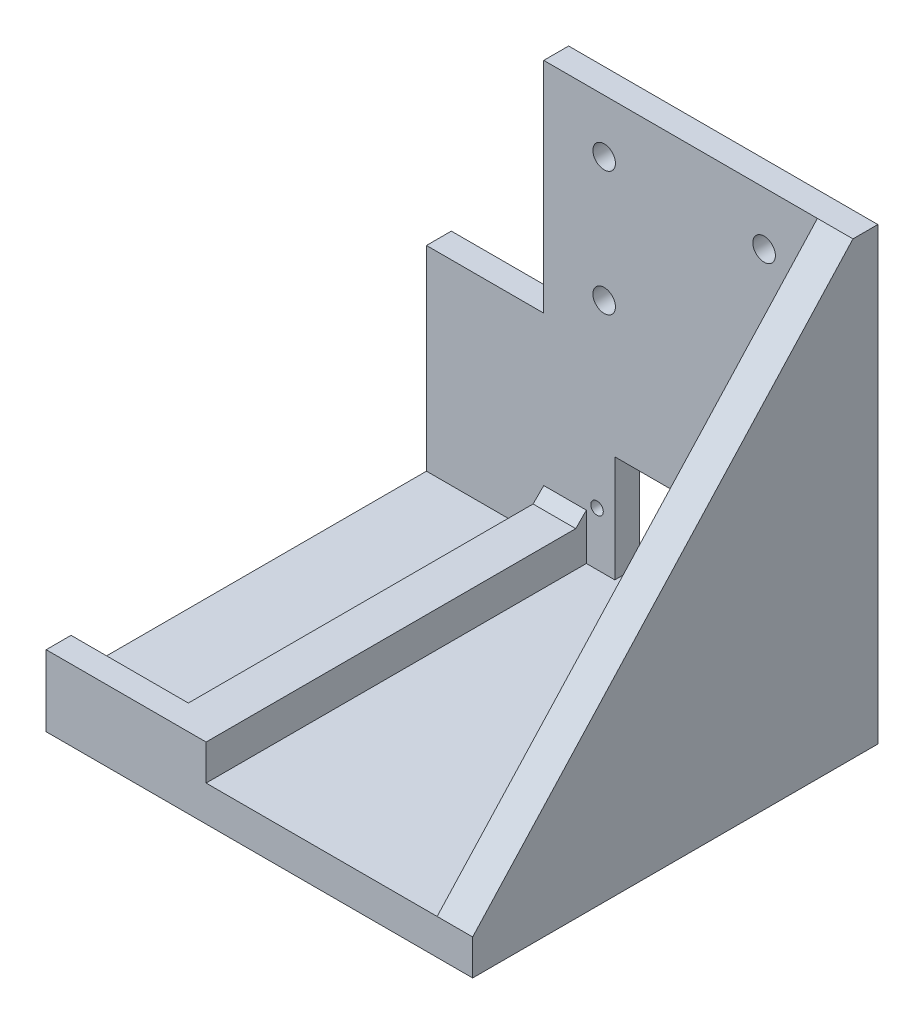
ISO-10303-21;
HEADER;
FILE_DESCRIPTION(('STEP AP214'),'2;1');
FILE_NAME('part.step','',(''),(''),'','','');
FILE_SCHEMA(('AUTOMOTIVE_DESIGN { 1 0 10303 214 1 1 1 1 }'));
ENDSEC;
DATA;
#1=APPLICATION_CONTEXT('core data for automotive mechanical design processes');
#2=APPLICATION_PROTOCOL_DEFINITION('international standard','automotive_design',2000,#1);
#3=PRODUCT_CONTEXT('',#1,'mechanical');
#4=PRODUCT('Part','Part','',(#3));
#5=PRODUCT_RELATED_PRODUCT_CATEGORY('part','',(#4));
#6=PRODUCT_DEFINITION_FORMATION('','',#4);
#7=PRODUCT_DEFINITION_CONTEXT('part definition',#1,'design');
#8=PRODUCT_DEFINITION('design','',#6,#7);
#9=PRODUCT_DEFINITION_SHAPE('','',#8);
#10=(LENGTH_UNIT() NAMED_UNIT(*) SI_UNIT(.MILLI.,.METRE.));
#11=(NAMED_UNIT(*) PLANE_ANGLE_UNIT() SI_UNIT($,.RADIAN.));
#12=(NAMED_UNIT(*) SI_UNIT($,.STERADIAN.) SOLID_ANGLE_UNIT());
#13=UNCERTAINTY_MEASURE_WITH_UNIT(LENGTH_MEASURE(1.E-05),#10,'distance_accuracy_value','');
#14=(GEOMETRIC_REPRESENTATION_CONTEXT(3) GLOBAL_UNCERTAINTY_ASSIGNED_CONTEXT((#13)) GLOBAL_UNIT_ASSIGNED_CONTEXT((#10,
#11,#12)) REPRESENTATION_CONTEXT('',''));
#15=CARTESIAN_POINT('',(0.,0.,0.));
#16=DIRECTION('',(0.,0.,1.));
#17=DIRECTION('',(1.,0.,0.));
#18=AXIS2_PLACEMENT_3D('',#15,#16,#17);
#19=CARTESIAN_POINT('',(37.,22.5,-57.));
#20=DIRECTION('',(-1.,0.,0.));
#21=DIRECTION('',(0.,0.,1.));
#22=AXIS2_PLACEMENT_3D('',#19,#20,#21);
#23=PLANE('',#22);
#24=DIRECTION('',(0.,1.,0.));
#25=VECTOR('',#24,1.);
#26=CARTESIAN_POINT('',(37.,22.5,-54.));
#27=LINE('',#26,#25);
#28=CARTESIAN_POINT('',(37.,3.,-54.));
#29=VERTEX_POINT('',#28);
#30=CARTESIAN_POINT('',(37.,22.5,-54.));
#31=VERTEX_POINT('',#30);
#32=EDGE_CURVE('E323',#29,#31,#27,.T.);
#33=ORIENTED_EDGE('',*,*,#32,.F.);
#34=DIRECTION('',(0.,0.,1.));
#35=VECTOR('',#34,1.);
#36=CARTESIAN_POINT('',(37.,3.,-57.));
#37=LINE('',#36,#35);
#38=CARTESIAN_POINT('',(37.,3.,-57.));
#39=VERTEX_POINT('',#38);
#40=EDGE_CURVE('E337',#39,#29,#37,.T.);
#41=ORIENTED_EDGE('',*,*,#40,.F.);
#42=DIRECTION('',(0.,-1.,0.));
#43=VECTOR('',#42,1.);
#44=CARTESIAN_POINT('',(37.,22.5,-57.));
#45=LINE('',#44,#43);
#46=CARTESIAN_POINT('',(37.,22.5,-57.));
#47=VERTEX_POINT('',#46);
#48=EDGE_CURVE('E325',#47,#39,#45,.T.);
#49=ORIENTED_EDGE('',*,*,#48,.F.);
#50=DIRECTION('',(0.,0.,1.));
#51=VECTOR('',#50,1.);
#52=CARTESIAN_POINT('',(37.,22.5,-57.));
#53=LINE('',#52,#51);
#54=EDGE_CURVE('E338',#47,#31,#53,.T.);
#55=ORIENTED_EDGE('',*,*,#54,.T.);
#56=EDGE_LOOP('',(#33,#41,#49,#55));
#57=FACE_BOUND('',#56,.T.);
#58=ADVANCED_FACE('F38',(#57),#23,.F.);
#59=CARTESIAN_POINT('',(37.,22.5,-57.));
#60=DIRECTION('',(0.,1.,0.));
#61=DIRECTION('',(0.,0.,1.));
#62=AXIS2_PLACEMENT_3D('',#59,#60,#61);
#63=PLANE('',#62);
#64=DIRECTION('',(1.,0.,0.));
#65=VECTOR('',#64,1.);
#66=CARTESIAN_POINT('',(37.,22.5,-54.));
#67=LINE('',#66,#65);
#68=CARTESIAN_POINT('',(50.,22.5,-54.));
#69=VERTEX_POINT('',#68);
#70=EDGE_CURVE('E321',#31,#69,#67,.T.);
#71=ORIENTED_EDGE('',*,*,#70,.F.);
#72=ORIENTED_EDGE('',*,*,#54,.F.);
#73=DIRECTION('',(-1.,0.,0.));
#74=VECTOR('',#73,1.);
#75=CARTESIAN_POINT('',(37.,22.5,-57.));
#76=LINE('',#75,#74);
#77=CARTESIAN_POINT('',(50.,22.5,-57.));
#78=VERTEX_POINT('',#77);
#79=EDGE_CURVE('E334',#78,#47,#76,.T.);
#80=ORIENTED_EDGE('',*,*,#79,.F.);
#81=DIRECTION('',(0.,0.,1.));
#82=VECTOR('',#81,1.);
#83=CARTESIAN_POINT('',(50.,22.5,-57.));
#84=LINE('',#83,#82);
#85=EDGE_CURVE('E342',#78,#69,#84,.T.);
#86=ORIENTED_EDGE('',*,*,#85,.T.);
#87=EDGE_LOOP('',(#71,#72,#80,#86));
#88=FACE_BOUND('',#87,.T.);
#89=ADVANCED_FACE('F540',(#88),#63,.F.);
#90=CARTESIAN_POINT('',(50.,22.5,-57.));
#91=DIRECTION('',(1.,0.,0.));
#92=DIRECTION('',(0.,0.,-1.));
#93=AXIS2_PLACEMENT_3D('',#90,#91,#92);
#94=PLANE('',#93);
#95=DIRECTION('',(0.,-1.,0.));
#96=VECTOR('',#95,1.);
#97=CARTESIAN_POINT('',(50.,22.5,-54.));
#98=LINE('',#97,#96);
#99=CARTESIAN_POINT('',(50.,3.,-54.));
#100=VERTEX_POINT('',#99);
#101=EDGE_CURVE('E313',#69,#100,#98,.T.);
#102=ORIENTED_EDGE('',*,*,#101,.F.);
#103=ORIENTED_EDGE('',*,*,#85,.F.);
#104=DIRECTION('',(0.,1.,0.));
#105=VECTOR('',#104,1.);
#106=CARTESIAN_POINT('',(50.,22.5,-57.));
#107=LINE('',#106,#105);
#108=CARTESIAN_POINT('',(50.,3.,-57.));
#109=VERTEX_POINT('',#108);
#110=EDGE_CURVE('E331',#109,#78,#107,.T.);
#111=ORIENTED_EDGE('',*,*,#110,.F.);
#112=DIRECTION('',(0.,0.,1.));
#113=VECTOR('',#112,1.);
#114=CARTESIAN_POINT('',(50.,3.,-57.));
#115=LINE('',#114,#113);
#116=EDGE_CURVE('E345',#109,#100,#115,.T.);
#117=ORIENTED_EDGE('',*,*,#116,.T.);
#118=EDGE_LOOP('',(#102,#103,#111,#117));
#119=FACE_BOUND('',#118,.T.);
#120=ADVANCED_FACE('F546',(#119),#94,.F.);
#121=CARTESIAN_POINT('',(37.,3.,-57.));
#122=DIRECTION('',(0.,-1.,0.));
#123=DIRECTION('',(0.,0.,-1.));
#124=AXIS2_PLACEMENT_3D('',#121,#122,#123);
#125=PLANE('',#124);
#126=DIRECTION('',(-1.,0.,0.));
#127=VECTOR('',#126,1.);
#128=CARTESIAN_POINT('',(37.,3.,-54.));
#129=LINE('',#128,#127);
#130=EDGE_CURVE('E454',#100,#29,#129,.T.);
#131=ORIENTED_EDGE('',*,*,#130,.F.);
#132=ORIENTED_EDGE('',*,*,#116,.F.);
#133=DIRECTION('',(1.,0.,0.));
#134=VECTOR('',#133,1.);
#135=CARTESIAN_POINT('',(37.,3.,-57.));
#136=LINE('',#135,#134);
#137=EDGE_CURVE('E328',#39,#109,#136,.T.);
#138=ORIENTED_EDGE('',*,*,#137,.F.);
#139=ORIENTED_EDGE('',*,*,#40,.T.);
#140=EDGE_LOOP('',(#131,#132,#138,#139));
#141=FACE_BOUND('',#140,.T.);
#142=ADVANCED_FACE('F551',(#141),#125,.F.);
#143=CARTESIAN_POINT('',(0.,0.,0.));
#144=DIRECTION('',(0.,-1.,0.));
#145=DIRECTION('',(0.,0.,-1.));
#146=AXIS2_PLACEMENT_3D('',#143,#144,#145);
#147=PLANE('',#146);
#148=DIRECTION('',(1.,0.,0.));
#149=VECTOR('',#148,1.);
#150=CARTESIAN_POINT('',(-55.,0.,-50.));
#151=LINE('',#150,#149);
#152=CARTESIAN_POINT('',(-9.99999999999998,0.,-50.));
#153=VERTEX_POINT('',#152);
#154=CARTESIAN_POINT('',(-1.99999999999997,0.,-50.));
#155=VERTEX_POINT('',#154);
#156=EDGE_CURVE('E394',#153,#155,#151,.T.);
#157=ORIENTED_EDGE('',*,*,#156,.F.);
#158=DIRECTION('',(0.,0.,-1.));
#159=VECTOR('',#158,1.);
#160=CARTESIAN_POINT('',(-9.99999999999998,0.,57.));
#161=LINE('',#160,#159);
#162=CARTESIAN_POINT('',(-9.99999999999998,0.,57.));
#163=VERTEX_POINT('',#162);
#164=EDGE_CURVE('E421',#163,#153,#161,.T.);
#165=ORIENTED_EDGE('',*,*,#164,.F.);
#166=DIRECTION('',(1.,0.,0.));
#167=VECTOR('',#166,1.);
#168=CARTESIAN_POINT('',(-55.,0.,57.));
#169=LINE('',#168,#167);
#170=CARTESIAN_POINT('',(55.,0.,57.));
#171=VERTEX_POINT('',#170);
#172=EDGE_CURVE('E442',#163,#171,#169,.T.);
#173=ORIENTED_EDGE('',*,*,#172,.T.);
#174=DIRECTION('',(0.,0.,-1.));
#175=VECTOR('',#174,1.);
#176=CARTESIAN_POINT('',(55.,0.,57.));
#177=LINE('',#176,#175);
#178=CARTESIAN_POINT('',(55.,0.,-50.));
#179=VERTEX_POINT('',#178);
#180=EDGE_CURVE('E438',#171,#179,#177,.T.);
#181=ORIENTED_EDGE('',*,*,#180,.T.);
#182=CARTESIAN_POINT('',(24.,0.,-50.));
#183=VERTEX_POINT('',#182);
#184=EDGE_CURVE('E386',#183,#179,#151,.T.);
#185=ORIENTED_EDGE('',*,*,#184,.F.);
#186=DIRECTION('',(0.,0.,1.));
#187=VECTOR('',#186,1.);
#188=CARTESIAN_POINT('',(24.,0.,-57.));
#189=LINE('',#188,#187);
#190=CARTESIAN_POINT('',(24.,0.,-57.));
#191=VERTEX_POINT('',#190);
#192=EDGE_CURVE('E375',#191,#183,#189,.T.);
#193=ORIENTED_EDGE('',*,*,#192,.F.);
#194=DIRECTION('',(1.,0.,0.));
#195=VECTOR('',#194,1.);
#196=CARTESIAN_POINT('',(-1.99999999999998,0.,-57.));
#197=LINE('',#196,#195);
#198=CARTESIAN_POINT('',(-1.99999999999998,0.,-57.));
#199=VERTEX_POINT('',#198);
#200=EDGE_CURVE('E353',#199,#191,#197,.T.);
#201=ORIENTED_EDGE('',*,*,#200,.F.);
#202=DIRECTION('',(0.,0.,1.));
#203=VECTOR('',#202,1.);
#204=CARTESIAN_POINT('',(-1.99999999999998,0.,-57.));
#205=LINE('',#204,#203);
#206=EDGE_CURVE('E363',#199,#155,#205,.T.);
#207=ORIENTED_EDGE('',*,*,#206,.T.);
#208=EDGE_LOOP('',(#157,#165,#173,#181,#185,#193,#201,#207));
#209=FACE_BOUND('',#208,.T.);
#210=ADVANCED_FACE('F480',(#209),#147,.F.);
#211=CARTESIAN_POINT('',(-9.99999999999998,10.,57.));
#212=DIRECTION('',(-1.,0.,0.));
#213=DIRECTION('',(0.,0.,1.));
#214=AXIS2_PLACEMENT_3D('',#211,#212,#213);
#215=PLANE('',#214);
#216=DIRECTION('',(0.,-1.,0.));
#217=VECTOR('',#216,1.);
#218=CARTESIAN_POINT('',(-9.99999999999998,10.,-50.));
#219=LINE('',#218,#217);
#220=CARTESIAN_POINT('',(-9.99999999999998,13.,-50.));
#221=VERTEX_POINT('',#220);
#222=EDGE_CURVE('E61',#221,#153,#219,.T.);
#223=ORIENTED_EDGE('',*,*,#222,.F.);
#224=DIRECTION('',(0.,-0.707106781186544,0.707106781186551));
#225=VECTOR('',#224,1.);
#226=CARTESIAN_POINT('',(-9.99999999999998,-42.,5.0000000000005));
#227=LINE('',#226,#225);
#228=CARTESIAN_POINT('',(-9.99999999999998,10.,-47.));
#229=VERTEX_POINT('',#228);
#230=EDGE_CURVE('E12',#221,#229,#227,.T.);
#231=ORIENTED_EDGE('',*,*,#230,.T.);
#232=DIRECTION('',(0.,0.,-1.));
#233=VECTOR('',#232,1.);
#234=CARTESIAN_POINT('',(-9.99999999999998,10.,57.));
#235=LINE('',#234,#233);
#236=CARTESIAN_POINT('',(-9.99999999999998,10.,57.));
#237=VERTEX_POINT('',#236);
#238=EDGE_CURVE('E413',#237,#229,#235,.T.);
#239=ORIENTED_EDGE('',*,*,#238,.F.);
#240=DIRECTION('',(0.,-1.,0.));
#241=VECTOR('',#240,1.);
#242=CARTESIAN_POINT('',(-9.99999999999998,10.,57.));
#243=LINE('',#242,#241);
#244=EDGE_CURVE('E432',#237,#163,#243,.T.);
#245=ORIENTED_EDGE('',*,*,#244,.T.);
#246=ORIENTED_EDGE('',*,*,#164,.T.);
#247=EDGE_LOOP('',(#223,#231,#239,#245,#246));
#248=FACE_BOUND('',#247,.T.);
#249=ADVANCED_FACE('F483',(#248),#215,.F.);
#250=CARTESIAN_POINT('',(0.,10.,0.));
#251=DIRECTION('',(0.,1.,0.));
#252=DIRECTION('',(0.,0.,1.));
#253=AXIS2_PLACEMENT_3D('',#250,#251,#252);
#254=PLANE('',#253);
#255=ORIENTED_EDGE('',*,*,#238,.T.);
#256=DIRECTION('',(-1.,0.,0.));
#257=VECTOR('',#256,1.);
#258=CARTESIAN_POINT('',(0.,10.,-47.));
#259=LINE('',#258,#257);
#260=CARTESIAN_POINT('',(-22.,10.,-47.));
#261=VERTEX_POINT('',#260);
#262=EDGE_CURVE('E458',#229,#261,#259,.T.);
#263=ORIENTED_EDGE('',*,*,#262,.T.);
#264=DIRECTION('',(0.,0.,1.));
#265=VECTOR('',#264,1.);
#266=CARTESIAN_POINT('',(-22.,10.,-50.));
#267=LINE('',#266,#265);
#268=CARTESIAN_POINT('',(-22.,10.,50.));
#269=VERTEX_POINT('',#268);
#270=EDGE_CURVE('E416',#261,#269,#267,.T.);
#271=ORIENTED_EDGE('',*,*,#270,.T.);
#272=DIRECTION('',(-1.,0.,0.));
#273=VECTOR('',#272,1.);
#274=CARTESIAN_POINT('',(-22.,10.,50.));
#275=LINE('',#274,#273);
#276=CARTESIAN_POINT('',(-55.,10.,50.));
#277=VERTEX_POINT('',#276);
#278=EDGE_CURVE('E404',#269,#277,#275,.T.);
#279=ORIENTED_EDGE('',*,*,#278,.T.);
#280=DIRECTION('',(0.,0.,1.));
#281=VECTOR('',#280,1.);
#282=CARTESIAN_POINT('',(-55.,10.,50.));
#283=LINE('',#282,#281);
#284=CARTESIAN_POINT('',(-55.,10.,57.));
#285=VERTEX_POINT('',#284);
#286=EDGE_CURVE('E407',#277,#285,#283,.T.);
#287=ORIENTED_EDGE('',*,*,#286,.T.);
#288=DIRECTION('',(1.,0.,0.));
#289=VECTOR('',#288,1.);
#290=CARTESIAN_POINT('',(-55.,10.,57.));
#291=LINE('',#290,#289);
#292=EDGE_CURVE('E411',#285,#237,#291,.T.);
#293=ORIENTED_EDGE('',*,*,#292,.T.);
#294=EDGE_LOOP('',(#255,#263,#271,#279,#287,#293));
#295=FACE_BOUND('',#294,.T.);
#296=ADVANCED_FACE('F655',(#295),#254,.T.);
#297=DIRECTION('',(-1.,0.,0.));
#298=VECTOR('',#297,1.);
#299=CARTESIAN_POINT('',(-22.,0.,50.));
#300=LINE('',#299,#298);
#301=CARTESIAN_POINT('',(-22.,0.,50.));
#302=VERTEX_POINT('',#301);
#303=CARTESIAN_POINT('',(-55.,0.,50.));
#304=VERTEX_POINT('',#303);
#305=EDGE_CURVE('E403',#302,#304,#300,.T.);
#306=ORIENTED_EDGE('',*,*,#305,.F.);
#307=DIRECTION('',(0.,0.,1.));
#308=VECTOR('',#307,1.);
#309=CARTESIAN_POINT('',(-22.,0.,-50.));
#310=LINE('',#309,#308);
#311=CARTESIAN_POINT('',(-22.,0.,-50.));
#312=VERTEX_POINT('',#311);
#313=EDGE_CURVE('E408',#312,#302,#310,.T.);
#314=ORIENTED_EDGE('',*,*,#313,.F.);
#315=DIRECTION('',(1.,0.,0.));
#316=VECTOR('',#315,1.);
#317=CARTESIAN_POINT('',(-55.,0.,-50.));
#318=LINE('',#317,#316);
#319=CARTESIAN_POINT('',(-55.,0.,-50.));
#320=VERTEX_POINT('',#319);
#321=EDGE_CURVE('E423',#320,#312,#318,.T.);
#322=ORIENTED_EDGE('',*,*,#321,.F.);
#323=DIRECTION('',(0.,0.,1.));
#324=VECTOR('',#323,1.);
#325=CARTESIAN_POINT('',(-55.,0.,57.));
#326=LINE('',#325,#324);
#327=EDGE_CURVE('E449',#320,#304,#326,.T.);
#328=ORIENTED_EDGE('',*,*,#327,.T.);
#329=EDGE_LOOP('',(#306,#314,#322,#328));
#330=FACE_BOUND('',#329,.T.);
#331=ADVANCED_FACE('F653',(#330),#147,.F.);
#332=CARTESIAN_POINT('',(-55.,-10.,57.));
#333=DIRECTION('',(0.,0.,1.));
#334=DIRECTION('',(1.,0.,0.));
#335=AXIS2_PLACEMENT_3D('',#332,#333,#334);
#336=PLANE('',#335);
#337=ORIENTED_EDGE('',*,*,#172,.F.);
#338=ORIENTED_EDGE('',*,*,#244,.F.);
#339=ORIENTED_EDGE('',*,*,#292,.F.);
#340=DIRECTION('',(0.,1.,0.));
#341=VECTOR('',#340,1.);
#342=CARTESIAN_POINT('',(-55.,-10.,57.));
#343=LINE('',#342,#341);
#344=CARTESIAN_POINT('',(-55.,-10.,57.));
#345=VERTEX_POINT('',#344);
#346=EDGE_CURVE('E452',#345,#285,#343,.T.);
#347=ORIENTED_EDGE('',*,*,#346,.F.);
#348=DIRECTION('',(1.,0.,0.));
#349=VECTOR('',#348,1.);
#350=CARTESIAN_POINT('',(-55.,-10.,57.));
#351=LINE('',#350,#349);
#352=CARTESIAN_POINT('',(65.,-10.,57.));
#353=VERTEX_POINT('',#352);
#354=EDGE_CURVE('E445',#345,#353,#351,.T.);
#355=ORIENTED_EDGE('',*,*,#354,.T.);
#356=DIRECTION('',(0.,-1.,0.));
#357=VECTOR('',#356,1.);
#358=CARTESIAN_POINT('',(65.,0.,57.));
#359=LINE('',#358,#357);
#360=CARTESIAN_POINT('',(65.,0.,57.));
#361=VERTEX_POINT('',#360);
#362=EDGE_CURVE('E256',#361,#353,#359,.T.);
#363=ORIENTED_EDGE('',*,*,#362,.F.);
#364=DIRECTION('',(-1.,0.,0.));
#365=VECTOR('',#364,1.);
#366=CARTESIAN_POINT('',(65.,0.,57.));
#367=LINE('',#366,#365);
#368=EDGE_CURVE('E258',#361,#171,#367,.T.);
#369=ORIENTED_EDGE('',*,*,#368,.T.);
#370=EDGE_LOOP('',(#337,#338,#339,#347,#355,#363,#369));
#371=FACE_BOUND('',#370,.T.);
#372=ADVANCED_FACE('F488',(#371),#336,.T.);
#373=CARTESIAN_POINT('',(-55.,-10.,57.));
#374=DIRECTION('',(-1.,0.,0.));
#375=DIRECTION('',(0.,0.,1.));
#376=AXIS2_PLACEMENT_3D('',#373,#374,#375);
#377=PLANE('',#376);
#378=DIRECTION('',(0.,0.,1.));
#379=VECTOR('',#378,1.);
#380=CARTESIAN_POINT('',(-55.,54.9999999999989,-50.0000000000001));
#381=LINE('',#380,#379);
#382=CARTESIAN_POINT('',(-55.,54.9999999999989,-57.));
#383=VERTEX_POINT('',#382);
#384=CARTESIAN_POINT('',(-55.,54.9999999999989,-50.));
#385=VERTEX_POINT('',#384);
#386=EDGE_CURVE('E384',#383,#385,#381,.T.);
#387=ORIENTED_EDGE('',*,*,#386,.F.);
#388=DIRECTION('',(0.,1.,0.));
#389=VECTOR('',#388,1.);
#390=CARTESIAN_POINT('',(-55.,-10.,-57.));
#391=LINE('',#390,#389);
#392=CARTESIAN_POINT('',(-55.,-10.,-57.));
#393=VERTEX_POINT('',#392);
#394=EDGE_CURVE('E447',#393,#383,#391,.T.);
#395=ORIENTED_EDGE('',*,*,#394,.F.);
#396=DIRECTION('',(0.,0.,1.));
#397=VECTOR('',#396,1.);
#398=CARTESIAN_POINT('',(-55.,-10.,57.));
#399=LINE('',#398,#397);
#400=EDGE_CURVE('E441',#393,#345,#399,.T.);
#401=ORIENTED_EDGE('',*,*,#400,.T.);
#402=ORIENTED_EDGE('',*,*,#346,.T.);
#403=ORIENTED_EDGE('',*,*,#286,.F.);
#404=DIRECTION('',(0.,-1.,0.));
#405=VECTOR('',#404,1.);
#406=CARTESIAN_POINT('',(-55.,10.,50.));
#407=LINE('',#406,#405);
#408=EDGE_CURVE('E435',#277,#304,#407,.T.);
#409=ORIENTED_EDGE('',*,*,#408,.T.);
#410=ORIENTED_EDGE('',*,*,#327,.F.);
#411=DIRECTION('',(0.,-1.,0.));
#412=VECTOR('',#411,1.);
#413=CARTESIAN_POINT('',(-55.,10.,-50.));
#414=LINE('',#413,#412);
#415=EDGE_CURVE('E430',#385,#320,#414,.T.);
#416=ORIENTED_EDGE('',*,*,#415,.F.);
#417=EDGE_LOOP('',(#387,#395,#401,#402,#403,#409,#410,#416));
#418=FACE_BOUND('',#417,.T.);
#419=ADVANCED_FACE('F506',(#418),#377,.T.);
#420=CARTESIAN_POINT('',(-55.,-10.,-57.));
#421=DIRECTION('',(0.,0.,-1.));
#422=DIRECTION('',(-1.,0.,0.));
#423=AXIS2_PLACEMENT_3D('',#420,#421,#422);
#424=PLANE('',#423);
#425=CARTESIAN_POINT('',(29.0000000000002,15.0000000000006,-57.));
#426=DIRECTION('',(0.,0.,-1.));
#427=DIRECTION('',(-1.,0.,0.));
#428=AXIS2_PLACEMENT_3D('',#425,#426,#427);
#429=CIRCLE('',#428,1.75);
#430=CARTESIAN_POINT('',(27.2500000000002,15.0000000000006,-57.));
#431=VERTEX_POINT('',#430);
#432=EDGE_CURVE('E462',#431,#431,#429,.T.);
#433=ORIENTED_EDGE('',*,*,#432,.F.);
#434=EDGE_LOOP('',(#433));
#435=FACE_BOUND('',#434,.T.);
#436=CARTESIAN_POINT('',(-6.9999999999998,15.0000000000006,-57.));
#437=DIRECTION('',(0.,0.,-1.));
#438=DIRECTION('',(-1.,0.,0.));
#439=AXIS2_PLACEMENT_3D('',#436,#437,#438);
#440=CIRCLE('',#439,1.75);
#441=CARTESIAN_POINT('',(-8.7499999999998,15.0000000000006,-57.));
#442=VERTEX_POINT('',#441);
#443=EDGE_CURVE('E252',#442,#442,#440,.T.);
#444=ORIENTED_EDGE('',*,*,#443,.F.);
#445=EDGE_LOOP('',(#444));
#446=FACE_BOUND('',#445,.T.);
#447=CARTESIAN_POINT('',(40.,101.599999999999,-57.));
#448=DIRECTION('',(0.,0.,1.));
#449=DIRECTION('',(1.,0.,0.));
#450=AXIS2_PLACEMENT_3D('',#447,#448,#449);
#451=CIRCLE('',#450,3.175);
#452=CARTESIAN_POINT('',(43.175,101.599999999999,-57.));
#453=VERTEX_POINT('',#452);
#454=EDGE_CURVE('E270',#453,#453,#451,.T.);
#455=ORIENTED_EDGE('',*,*,#454,.T.);
#456=EDGE_LOOP('',(#455));
#457=FACE_BOUND('',#456,.T.);
#458=CARTESIAN_POINT('',(-4.99999999999966,66.5999999999987,-57.));
#459=DIRECTION('',(0.,0.,1.));
#460=DIRECTION('',(1.,0.,0.));
#461=AXIS2_PLACEMENT_3D('',#458,#459,#460);
#462=CIRCLE('',#461,3.17499999999999);
#463=CARTESIAN_POINT('',(-1.82499999999967,66.5999999999987,-57.));
#464=VERTEX_POINT('',#463);
#465=EDGE_CURVE('E277',#464,#464,#462,.T.);
#466=ORIENTED_EDGE('',*,*,#465,.T.);
#467=EDGE_LOOP('',(#466));
#468=FACE_BOUND('',#467,.T.);
#469=CARTESIAN_POINT('',(40.0000000000003,66.5999999999987,-57.));
#470=DIRECTION('',(0.,0.,1.));
#471=DIRECTION('',(1.,0.,0.));
#472=AXIS2_PLACEMENT_3D('',#469,#470,#471);
#473=CIRCLE('',#472,3.175);
#474=CARTESIAN_POINT('',(43.1750000000003,66.5999999999987,-57.));
#475=VERTEX_POINT('',#474);
#476=EDGE_CURVE('E264',#475,#475,#473,.T.);
#477=ORIENTED_EDGE('',*,*,#476,.T.);
#478=EDGE_LOOP('',(#477));
#479=FACE_BOUND('',#478,.T.);
#480=CARTESIAN_POINT('',(-5.00000000000002,101.599999999999,-57.));
#481=DIRECTION('',(0.,0.,1.));
#482=DIRECTION('',(1.,0.,0.));
#483=AXIS2_PLACEMENT_3D('',#480,#481,#482);
#484=CIRCLE('',#483,3.17499999999999);
#485=CARTESIAN_POINT('',(-1.82500000000003,101.599999999999,-57.));
#486=VERTEX_POINT('',#485);
#487=EDGE_CURVE('E282',#486,#486,#484,.T.);
#488=ORIENTED_EDGE('',*,*,#487,.T.);
#489=EDGE_LOOP('',(#488));
#490=FACE_BOUND('',#489,.T.);
#491=ORIENTED_EDGE('',*,*,#48,.T.);
#492=ORIENTED_EDGE('',*,*,#137,.T.);
#493=ORIENTED_EDGE('',*,*,#110,.T.);
#494=ORIENTED_EDGE('',*,*,#79,.T.);
#495=EDGE_LOOP('',(#491,#492,#493,#494));
#496=FACE_BOUND('',#495,.T.);
#497=DIRECTION('',(0.,-1.,0.));
#498=VECTOR('',#497,1.);
#499=CARTESIAN_POINT('',(-1.99999999999998,0.,-57.));
#500=LINE('',#499,#498);
#501=CARTESIAN_POINT('',(-1.99999999999998,30.,-57.));
#502=VERTEX_POINT('',#501);
#503=EDGE_CURVE('E350',#502,#199,#500,.T.);
#504=ORIENTED_EDGE('',*,*,#503,.T.);
#505=ORIENTED_EDGE('',*,*,#200,.T.);
#506=DIRECTION('',(0.,1.,0.));
#507=VECTOR('',#506,1.);
#508=CARTESIAN_POINT('',(24.,0.,-57.));
#509=LINE('',#508,#507);
#510=CARTESIAN_POINT('',(24.,30.,-57.));
#511=VERTEX_POINT('',#510);
#512=EDGE_CURVE('E357',#191,#511,#509,.T.);
#513=ORIENTED_EDGE('',*,*,#512,.T.);
#514=DIRECTION('',(-1.,0.,0.));
#515=VECTOR('',#514,1.);
#516=CARTESIAN_POINT('',(-1.99999999999998,30.,-57.));
#517=LINE('',#516,#515);
#518=EDGE_CURVE('E360',#511,#502,#517,.T.);
#519=ORIENTED_EDGE('',*,*,#518,.T.);
#520=EDGE_LOOP('',(#504,#505,#513,#519));
#521=FACE_BOUND('',#520,.T.);
#522=DIRECTION('',(-1.,0.,0.));
#523=VECTOR('',#522,1.);
#524=CARTESIAN_POINT('',(-55.,54.9999999999989,-57.));
#525=LINE('',#524,#523);
#526=CARTESIAN_POINT('',(-22.,54.9999999999989,-57.));
#527=VERTEX_POINT('',#526);
#528=EDGE_CURVE('E387',#527,#383,#525,.T.);
#529=ORIENTED_EDGE('',*,*,#528,.F.);
#530=DIRECTION('',(0.,1.,0.));
#531=VECTOR('',#530,1.);
#532=CARTESIAN_POINT('',(-22.,21.2657444131329,-57.));
#533=LINE('',#532,#531);
#534=CARTESIAN_POINT('',(-22.,116.599999999999,-57.));
#535=VERTEX_POINT('',#534);
#536=EDGE_CURVE('E227',#527,#535,#533,.T.);
#537=ORIENTED_EDGE('',*,*,#536,.T.);
#538=DIRECTION('',(1.,0.,0.));
#539=VECTOR('',#538,1.);
#540=CARTESIAN_POINT('',(55.,116.599999999999,-57.));
#541=LINE('',#540,#539);
#542=CARTESIAN_POINT('',(65.,116.599999999999,-57.));
#543=VERTEX_POINT('',#542);
#544=EDGE_CURVE('E220',#535,#543,#541,.T.);
#545=ORIENTED_EDGE('',*,*,#544,.T.);
#546=DIRECTION('',(0.,1.,0.));
#547=VECTOR('',#546,1.);
#548=CARTESIAN_POINT('',(65.,-10.,-57.));
#549=LINE('',#548,#547);
#550=CARTESIAN_POINT('',(65.,-10.,-57.));
#551=VERTEX_POINT('',#550);
#552=EDGE_CURVE('E226',#551,#543,#549,.T.);
#553=ORIENTED_EDGE('',*,*,#552,.F.);
#554=DIRECTION('',(-1.,0.,0.));
#555=VECTOR('',#554,1.);
#556=CARTESIAN_POINT('',(-55.,-10.,-57.));
#557=LINE('',#556,#555);
#558=EDGE_CURVE('E439',#551,#393,#557,.T.);
#559=ORIENTED_EDGE('',*,*,#558,.T.);
#560=ORIENTED_EDGE('',*,*,#394,.T.);
#561=EDGE_LOOP('',(#529,#537,#545,#553,#559,#560));
#562=FACE_BOUND('',#561,.T.);
#563=ADVANCED_FACE('F223',(#435,#446,#457,#468,#479,#490,#496,#521,#562),#424,.T.);
#564=CARTESIAN_POINT('',(0.,-10.,0.));
#565=DIRECTION('',(0.,-1.,0.));
#566=DIRECTION('',(0.,0.,-1.));
#567=AXIS2_PLACEMENT_3D('',#564,#565,#566);
#568=PLANE('',#567);
#569=ORIENTED_EDGE('',*,*,#558,.F.);
#570=DIRECTION('',(0.,0.,-1.));
#571=VECTOR('',#570,1.);
#572=CARTESIAN_POINT('',(65.,-10.,57.));
#573=LINE('',#572,#571);
#574=EDGE_CURVE('E245',#353,#551,#573,.T.);
#575=ORIENTED_EDGE('',*,*,#574,.F.);
#576=ORIENTED_EDGE('',*,*,#354,.F.);
#577=ORIENTED_EDGE('',*,*,#400,.F.);
#578=EDGE_LOOP('',(#569,#575,#576,#577));
#579=FACE_BOUND('',#578,.T.);
#580=ADVANCED_FACE('F502',(#579),#568,.T.);
#581=CARTESIAN_POINT('',(-22.,10.,50.));
#582=DIRECTION('',(0.,0.,1.));
#583=DIRECTION('',(1.,0.,0.));
#584=AXIS2_PLACEMENT_3D('',#581,#582,#583);
#585=PLANE('',#584);
#586=ORIENTED_EDGE('',*,*,#305,.T.);
#587=ORIENTED_EDGE('',*,*,#408,.F.);
#588=ORIENTED_EDGE('',*,*,#278,.F.);
#589=DIRECTION('',(0.,-1.,0.));
#590=VECTOR('',#589,1.);
#591=CARTESIAN_POINT('',(-22.,10.,50.));
#592=LINE('',#591,#590);
#593=EDGE_CURVE('E418',#269,#302,#592,.T.);
#594=ORIENTED_EDGE('',*,*,#593,.T.);
#595=EDGE_LOOP('',(#586,#587,#588,#594));
#596=FACE_BOUND('',#595,.T.);
#597=ADVANCED_FACE('F612',(#596),#585,.F.);
#598=CARTESIAN_POINT('',(-55.,10.,-50.));
#599=DIRECTION('',(0.,0.,-1.));
#600=DIRECTION('',(-1.,0.,0.));
#601=AXIS2_PLACEMENT_3D('',#598,#599,#600);
#602=PLANE('',#601);
#603=CARTESIAN_POINT('',(29.0000000000002,15.0000000000006,-50.));
#604=DIRECTION('',(0.,0.,-1.));
#605=DIRECTION('',(-1.,0.,0.));
#606=AXIS2_PLACEMENT_3D('',#603,#604,#605);
#607=CIRCLE('',#606,1.75);
#608=CARTESIAN_POINT('',(27.2500000000002,15.0000000000006,-50.));
#609=VERTEX_POINT('',#608);
#610=EDGE_CURVE('E249',#609,#609,#607,.T.);
#611=ORIENTED_EDGE('',*,*,#610,.T.);
#612=EDGE_LOOP('',(#611));
#613=FACE_BOUND('',#612,.T.);
#614=CARTESIAN_POINT('',(-6.9999999999998,15.0000000000006,-50.));
#615=DIRECTION('',(0.,0.,-1.));
#616=DIRECTION('',(-1.,0.,0.));
#617=AXIS2_PLACEMENT_3D('',#614,#615,#616);
#618=CIRCLE('',#617,1.75);
#619=CARTESIAN_POINT('',(-8.7499999999998,15.0000000000006,-50.));
#620=VERTEX_POINT('',#619);
#621=EDGE_CURVE('E459',#620,#620,#618,.T.);
#622=ORIENTED_EDGE('',*,*,#621,.T.);
#623=EDGE_LOOP('',(#622));
#624=FACE_BOUND('',#623,.T.);
#625=CARTESIAN_POINT('',(40.,101.599999999999,-50.));
#626=DIRECTION('',(0.,0.,1.));
#627=DIRECTION('',(1.,0.,0.));
#628=AXIS2_PLACEMENT_3D('',#625,#626,#627);
#629=CIRCLE('',#628,3.175);
#630=CARTESIAN_POINT('',(43.175,101.599999999999,-50.));
#631=VERTEX_POINT('',#630);
#632=EDGE_CURVE('E274',#631,#631,#629,.T.);
#633=ORIENTED_EDGE('',*,*,#632,.F.);
#634=EDGE_LOOP('',(#633));
#635=FACE_BOUND('',#634,.T.);
#636=CARTESIAN_POINT('',(-4.99999999999966,66.5999999999987,-50.));
#637=DIRECTION('',(0.,0.,1.));
#638=DIRECTION('',(1.,0.,0.));
#639=AXIS2_PLACEMENT_3D('',#636,#637,#638);
#640=CIRCLE('',#639,3.17499999999999);
#641=CARTESIAN_POINT('',(-1.82499999999967,66.5999999999987,-50.));
#642=VERTEX_POINT('',#641);
#643=EDGE_CURVE('E267',#642,#642,#640,.T.);
#644=ORIENTED_EDGE('',*,*,#643,.F.);
#645=EDGE_LOOP('',(#644));
#646=FACE_BOUND('',#645,.T.);
#647=CARTESIAN_POINT('',(40.0000000000003,66.5999999999987,-50.));
#648=DIRECTION('',(0.,0.,1.));
#649=DIRECTION('',(1.,0.,0.));
#650=AXIS2_PLACEMENT_3D('',#647,#648,#649);
#651=CIRCLE('',#650,3.175);
#652=CARTESIAN_POINT('',(43.1750000000003,66.5999999999987,-50.));
#653=VERTEX_POINT('',#652);
#654=EDGE_CURVE('E263',#653,#653,#651,.T.);
#655=ORIENTED_EDGE('',*,*,#654,.F.);
#656=EDGE_LOOP('',(#655));
#657=FACE_BOUND('',#656,.T.);
#658=CARTESIAN_POINT('',(-5.00000000000002,101.599999999999,-50.));
#659=DIRECTION('',(0.,0.,1.));
#660=DIRECTION('',(1.,0.,0.));
#661=AXIS2_PLACEMENT_3D('',#658,#659,#660);
#662=CIRCLE('',#661,3.17499999999999);
#663=CARTESIAN_POINT('',(-1.82500000000003,101.599999999999,-50.));
#664=VERTEX_POINT('',#663);
#665=EDGE_CURVE('E273',#664,#664,#662,.T.);
#666=ORIENTED_EDGE('',*,*,#665,.F.);
#667=EDGE_LOOP('',(#666));
#668=FACE_BOUND('',#667,.T.);
#669=DIRECTION('',(1.,0.,0.));
#670=VECTOR('',#669,1.);
#671=CARTESIAN_POINT('',(35.,1.,-50.));
#672=LINE('',#671,#670);
#673=CARTESIAN_POINT('',(35.,0.999999999999999,-50.));
#674=VERTEX_POINT('',#673);
#675=CARTESIAN_POINT('',(52.,1.,-50.));
#676=VERTEX_POINT('',#675);
#677=EDGE_CURVE('E303',#674,#676,#672,.T.);
#678=ORIENTED_EDGE('',*,*,#677,.F.);
#679=DIRECTION('',(0.,-1.,0.));
#680=VECTOR('',#679,1.);
#681=CARTESIAN_POINT('',(35.,24.5,-50.));
#682=LINE('',#681,#680);
#683=CARTESIAN_POINT('',(35.,24.5,-50.));
#684=VERTEX_POINT('',#683);
#685=EDGE_CURVE('E285',#684,#674,#682,.T.);
#686=ORIENTED_EDGE('',*,*,#685,.F.);
#687=DIRECTION('',(-1.,0.,0.));
#688=VECTOR('',#687,1.);
#689=CARTESIAN_POINT('',(52.,24.5,-50.));
#690=LINE('',#689,#688);
#691=CARTESIAN_POINT('',(52.,24.5,-50.));
#692=VERTEX_POINT('',#691);
#693=EDGE_CURVE('E292',#692,#684,#690,.T.);
#694=ORIENTED_EDGE('',*,*,#693,.F.);
#695=DIRECTION('',(0.,1.,0.));
#696=VECTOR('',#695,1.);
#697=CARTESIAN_POINT('',(52.,1.,-50.));
#698=LINE('',#697,#696);
#699=EDGE_CURVE('E306',#676,#692,#698,.T.);
#700=ORIENTED_EDGE('',*,*,#699,.F.);
#701=EDGE_LOOP('',(#678,#686,#694,#700));
#702=FACE_BOUND('',#701,.T.);
#703=DIRECTION('',(0.,-1.,0.));
#704=VECTOR('',#703,1.);
#705=CARTESIAN_POINT('',(-22.,10.,-50.));
#706=LINE('',#705,#704);
#707=CARTESIAN_POINT('',(-22.,13.,-50.));
#708=VERTEX_POINT('',#707);
#709=EDGE_CURVE('E54',#708,#312,#706,.T.);
#710=ORIENTED_EDGE('',*,*,#709,.F.);
#711=DIRECTION('',(1.,0.,0.));
#712=VECTOR('',#711,1.);
#713=CARTESIAN_POINT('',(-55.,13.,-50.));
#714=LINE('',#713,#712);
#715=EDGE_CURVE('E467',#708,#221,#714,.T.);
#716=ORIENTED_EDGE('',*,*,#715,.T.);
#717=ORIENTED_EDGE('',*,*,#222,.T.);
#718=ORIENTED_EDGE('',*,*,#156,.T.);
#719=DIRECTION('',(0.,-1.,0.));
#720=VECTOR('',#719,1.);
#721=CARTESIAN_POINT('',(-1.99999999999998,0.,-50.));
#722=LINE('',#721,#720);
#723=CARTESIAN_POINT('',(-1.99999999999998,30.,-50.));
#724=VERTEX_POINT('',#723);
#725=EDGE_CURVE('E341',#724,#155,#722,.T.);
#726=ORIENTED_EDGE('',*,*,#725,.F.);
#727=DIRECTION('',(-1.,0.,0.));
#728=VECTOR('',#727,1.);
#729=CARTESIAN_POINT('',(-1.99999999999998,30.,-50.));
#730=LINE('',#729,#728);
#731=CARTESIAN_POINT('',(24.,30.,-50.));
#732=VERTEX_POINT('',#731);
#733=EDGE_CURVE('E354',#732,#724,#730,.T.);
#734=ORIENTED_EDGE('',*,*,#733,.F.);
#735=DIRECTION('',(0.,1.,0.));
#736=VECTOR('',#735,1.);
#737=CARTESIAN_POINT('',(24.,0.,-50.));
#738=LINE('',#737,#736);
#739=EDGE_CURVE('E365',#183,#732,#738,.T.);
#740=ORIENTED_EDGE('',*,*,#739,.F.);
#741=ORIENTED_EDGE('',*,*,#184,.T.);
#742=DIRECTION('',(0.,-1.,0.));
#743=VECTOR('',#742,1.);
#744=CARTESIAN_POINT('',(55.,226.822502239786,-50.));
#745=LINE('',#744,#743);
#746=CARTESIAN_POINT('',(55.,116.599999999999,-50.));
#747=VERTEX_POINT('',#746);
#748=EDGE_CURVE('E397',#747,#179,#745,.T.);
#749=ORIENTED_EDGE('',*,*,#748,.F.);
#750=DIRECTION('',(-1.,0.,0.));
#751=VECTOR('',#750,1.);
#752=CARTESIAN_POINT('',(-55.,116.599999999999,-50.));
#753=LINE('',#752,#751);
#754=CARTESIAN_POINT('',(-22.,116.599999999999,-50.));
#755=VERTEX_POINT('',#754);
#756=EDGE_CURVE('E230',#747,#755,#753,.T.);
#757=ORIENTED_EDGE('',*,*,#756,.T.);
#758=DIRECTION('',(0.,1.,0.));
#759=VECTOR('',#758,1.);
#760=CARTESIAN_POINT('',(-22.,21.2657444131329,-50.));
#761=LINE('',#760,#759);
#762=CARTESIAN_POINT('',(-22.,54.9999999999989,-50.));
#763=VERTEX_POINT('',#762);
#764=EDGE_CURVE('E383',#763,#755,#761,.T.);
#765=ORIENTED_EDGE('',*,*,#764,.F.);
#766=DIRECTION('',(1.,0.,0.));
#767=VECTOR('',#766,1.);
#768=CARTESIAN_POINT('',(-55.,54.9999999999989,-50.));
#769=LINE('',#768,#767);
#770=EDGE_CURVE('E380',#385,#763,#769,.T.);
#771=ORIENTED_EDGE('',*,*,#770,.F.);
#772=ORIENTED_EDGE('',*,*,#415,.T.);
#773=ORIENTED_EDGE('',*,*,#321,.T.);
#774=EDGE_LOOP('',(#710,#716,#717,#718,#726,#734,#740,#741,#749,#757,#765,#771,#772,#773));
#775=FACE_BOUND('',#774,.T.);
#776=ADVANCED_FACE('F476',(#613,#624,#635,#646,#657,#668,#702,#775),#602,.F.);
#777=CARTESIAN_POINT('',(-22.,10.,-50.));
#778=DIRECTION('',(1.,0.,0.));
#779=DIRECTION('',(0.,0.,-1.));
#780=AXIS2_PLACEMENT_3D('',#777,#778,#779);
#781=PLANE('',#780);
#782=ORIENTED_EDGE('',*,*,#313,.T.);
#783=ORIENTED_EDGE('',*,*,#593,.F.);
#784=ORIENTED_EDGE('',*,*,#270,.F.);
#785=DIRECTION('',(0.,0.707106781186544,-0.707106781186551));
#786=VECTOR('',#785,1.);
#787=CARTESIAN_POINT('',(-22.,11.5,-48.5));
#788=LINE('',#787,#786);
#789=EDGE_CURVE('E47',#261,#708,#788,.T.);
#790=ORIENTED_EDGE('',*,*,#789,.T.);
#791=ORIENTED_EDGE('',*,*,#709,.T.);
#792=EDGE_LOOP('',(#782,#783,#784,#790,#791));
#793=FACE_BOUND('',#792,.T.);
#794=ADVANCED_FACE('F471',(#793),#781,.F.);
#795=CARTESIAN_POINT('',(313.983999999992,116.599999999999,-65.0000000000001));
#796=DIRECTION('',(0.,-1.,0.));
#797=DIRECTION('',(1.,0.,0.));
#798=AXIS2_PLACEMENT_3D('',#795,#796,#797);
#799=PLANE('',#798);
#800=ORIENTED_EDGE('',*,*,#544,.F.);
#801=DIRECTION('',(0.,0.,-1.));
#802=VECTOR('',#801,1.);
#803=CARTESIAN_POINT('',(-22.,116.599999999999,-50.));
#804=LINE('',#803,#802);
#805=EDGE_CURVE('E372',#755,#535,#804,.T.);
#806=ORIENTED_EDGE('',*,*,#805,.F.);
#807=ORIENTED_EDGE('',*,*,#756,.F.);
#808=DIRECTION('',(-1.,0.,0.));
#809=VECTOR('',#808,1.);
#810=CARTESIAN_POINT('',(65.,116.599999999999,-50.));
#811=LINE('',#810,#809);
#812=CARTESIAN_POINT('',(65.,116.599999999999,-50.));
#813=VERTEX_POINT('',#812);
#814=EDGE_CURVE('E236',#813,#747,#811,.T.);
#815=ORIENTED_EDGE('',*,*,#814,.F.);
#816=DIRECTION('',(0.,0.,1.));
#817=VECTOR('',#816,1.);
#818=CARTESIAN_POINT('',(65.,116.599999999999,-57.));
#819=LINE('',#818,#817);
#820=EDGE_CURVE('E233',#543,#813,#819,.T.);
#821=ORIENTED_EDGE('',*,*,#820,.F.);
#822=EDGE_LOOP('',(#800,#806,#807,#815,#821));
#823=FACE_BOUND('',#822,.T.);
#824=ADVANCED_FACE('F234',(#823),#799,.F.);
#825=CARTESIAN_POINT('',(-103.999999999999,54.999999999999,-19.0000000000001));
#826=DIRECTION('',(0.,-1.,0.));
#827=DIRECTION('',(-1.,0.,0.));
#828=AXIS2_PLACEMENT_3D('',#825,#826,#827);
#829=PLANE('',#828);
#830=ORIENTED_EDGE('',*,*,#386,.T.);
#831=ORIENTED_EDGE('',*,*,#770,.T.);
#832=DIRECTION('',(0.,0.,-1.));
#833=VECTOR('',#832,1.);
#834=CARTESIAN_POINT('',(-22.,54.999999999999,-50.0000000000001));
#835=LINE('',#834,#833);
#836=EDGE_CURVE('E389',#763,#527,#835,.T.);
#837=ORIENTED_EDGE('',*,*,#836,.T.);
#838=ORIENTED_EDGE('',*,*,#528,.T.);
#839=EDGE_LOOP('',(#830,#831,#837,#838));
#840=FACE_BOUND('',#839,.T.);
#841=ADVANCED_FACE('F511',(#840),#829,.F.);
#842=CARTESIAN_POINT('',(-22.,21.2657444131329,-50.));
#843=DIRECTION('',(1.,0.,0.));
#844=DIRECTION('',(0.,0.,-1.));
#845=AXIS2_PLACEMENT_3D('',#842,#843,#844);
#846=PLANE('',#845);
#847=ORIENTED_EDGE('',*,*,#764,.T.);
#848=ORIENTED_EDGE('',*,*,#805,.T.);
#849=ORIENTED_EDGE('',*,*,#536,.F.);
#850=ORIENTED_EDGE('',*,*,#836,.F.);
#851=EDGE_LOOP('',(#847,#848,#849,#850));
#852=FACE_BOUND('',#851,.T.);
#853=ADVANCED_FACE('F515',(#852),#846,.F.);
#854=CARTESIAN_POINT('',(-1.99999999999998,0.,-57.));
#855=DIRECTION('',(-1.,0.,0.));
#856=DIRECTION('',(0.,0.,1.));
#857=AXIS2_PLACEMENT_3D('',#854,#855,#856);
#858=PLANE('',#857);
#859=ORIENTED_EDGE('',*,*,#725,.T.);
#860=ORIENTED_EDGE('',*,*,#206,.F.);
#861=ORIENTED_EDGE('',*,*,#503,.F.);
#862=DIRECTION('',(0.,0.,1.));
#863=VECTOR('',#862,1.);
#864=CARTESIAN_POINT('',(-1.99999999999998,30.,-57.));
#865=LINE('',#864,#863);
#866=EDGE_CURVE('E370',#502,#724,#865,.T.);
#867=ORIENTED_EDGE('',*,*,#866,.T.);
#868=EDGE_LOOP('',(#859,#860,#861,#867));
#869=FACE_BOUND('',#868,.T.);
#870=ADVANCED_FACE('F523',(#869),#858,.F.);
#871=CARTESIAN_POINT('',(-1.99999999999998,30.,-57.));
#872=DIRECTION('',(0.,1.,0.));
#873=DIRECTION('',(0.,0.,1.));
#874=AXIS2_PLACEMENT_3D('',#871,#872,#873);
#875=PLANE('',#874);
#876=ORIENTED_EDGE('',*,*,#733,.T.);
#877=ORIENTED_EDGE('',*,*,#866,.F.);
#878=ORIENTED_EDGE('',*,*,#518,.F.);
#879=DIRECTION('',(0.,0.,1.));
#880=VECTOR('',#879,1.);
#881=CARTESIAN_POINT('',(24.,30.,-57.));
#882=LINE('',#881,#880);
#883=EDGE_CURVE('E373',#511,#732,#882,.T.);
#884=ORIENTED_EDGE('',*,*,#883,.T.);
#885=EDGE_LOOP('',(#876,#877,#878,#884));
#886=FACE_BOUND('',#885,.T.);
#887=ADVANCED_FACE('F525',(#886),#875,.F.);
#888=CARTESIAN_POINT('',(24.,0.,-57.));
#889=DIRECTION('',(1.,0.,0.));
#890=DIRECTION('',(0.,0.,-1.));
#891=AXIS2_PLACEMENT_3D('',#888,#889,#890);
#892=PLANE('',#891);
#893=ORIENTED_EDGE('',*,*,#739,.T.);
#894=ORIENTED_EDGE('',*,*,#883,.F.);
#895=ORIENTED_EDGE('',*,*,#512,.F.);
#896=ORIENTED_EDGE('',*,*,#192,.T.);
#897=EDGE_LOOP('',(#893,#894,#895,#896));
#898=FACE_BOUND('',#897,.T.);
#899=ADVANCED_FACE('F526',(#898),#892,.F.);
#900=CARTESIAN_POINT('',(0.,0.,-54.));
#901=DIRECTION('',(0.,0.,1.));
#902=DIRECTION('',(1.,0.,0.));
#903=AXIS2_PLACEMENT_3D('',#900,#901,#902);
#904=PLANE('',#903);
#905=DIRECTION('',(0.,-1.,0.));
#906=VECTOR('',#905,1.);
#907=CARTESIAN_POINT('',(35.,24.5,-54.));
#908=LINE('',#907,#906);
#909=CARTESIAN_POINT('',(35.,24.5,-54.));
#910=VERTEX_POINT('',#909);
#911=CARTESIAN_POINT('',(35.,1.,-54.));
#912=VERTEX_POINT('',#911);
#913=EDGE_CURVE('E288',#910,#912,#908,.T.);
#914=ORIENTED_EDGE('',*,*,#913,.T.);
#915=DIRECTION('',(1.,0.,0.));
#916=VECTOR('',#915,1.);
#917=CARTESIAN_POINT('',(35.,1.,-54.));
#918=LINE('',#917,#916);
#919=CARTESIAN_POINT('',(52.,1.,-54.));
#920=VERTEX_POINT('',#919);
#921=EDGE_CURVE('E291',#912,#920,#918,.T.);
#922=ORIENTED_EDGE('',*,*,#921,.T.);
#923=DIRECTION('',(0.,1.,0.));
#924=VECTOR('',#923,1.);
#925=CARTESIAN_POINT('',(52.,1.,-54.));
#926=LINE('',#925,#924);
#927=CARTESIAN_POINT('',(52.,24.5,-54.));
#928=VERTEX_POINT('',#927);
#929=EDGE_CURVE('E295',#920,#928,#926,.T.);
#930=ORIENTED_EDGE('',*,*,#929,.T.);
#931=DIRECTION('',(-1.,0.,0.));
#932=VECTOR('',#931,1.);
#933=CARTESIAN_POINT('',(52.,24.5,-54.));
#934=LINE('',#933,#932);
#935=EDGE_CURVE('E298',#928,#910,#934,.T.);
#936=ORIENTED_EDGE('',*,*,#935,.T.);
#937=EDGE_LOOP('',(#914,#922,#930,#936));
#938=FACE_BOUND('',#937,.T.);
#939=ORIENTED_EDGE('',*,*,#32,.T.);
#940=ORIENTED_EDGE('',*,*,#70,.T.);
#941=ORIENTED_EDGE('',*,*,#101,.T.);
#942=ORIENTED_EDGE('',*,*,#130,.T.);
#943=EDGE_LOOP('',(#939,#940,#941,#942));
#944=FACE_BOUND('',#943,.T.);
#945=ADVANCED_FACE('F528',(#938,#944),#904,.T.);
#946=CARTESIAN_POINT('',(35.,24.5,-54.));
#947=DIRECTION('',(-1.,0.,0.));
#948=DIRECTION('',(0.,0.,1.));
#949=AXIS2_PLACEMENT_3D('',#946,#947,#948);
#950=PLANE('',#949);
#951=ORIENTED_EDGE('',*,*,#685,.T.);
#952=DIRECTION('',(0.,0.,1.));
#953=VECTOR('',#952,1.);
#954=CARTESIAN_POINT('',(35.,1.,-54.));
#955=LINE('',#954,#953);
#956=EDGE_CURVE('E301',#912,#674,#955,.T.);
#957=ORIENTED_EDGE('',*,*,#956,.F.);
#958=ORIENTED_EDGE('',*,*,#913,.F.);
#959=DIRECTION('',(0.,0.,1.));
#960=VECTOR('',#959,1.);
#961=CARTESIAN_POINT('',(35.,24.5,-54.));
#962=LINE('',#961,#960);
#963=EDGE_CURVE('E311',#910,#684,#962,.T.);
#964=ORIENTED_EDGE('',*,*,#963,.T.);
#965=EDGE_LOOP('',(#951,#957,#958,#964));
#966=FACE_BOUND('',#965,.T.);
#967=ADVANCED_FACE('F534',(#966),#950,.F.);
#968=CARTESIAN_POINT('',(52.,24.5,-54.));
#969=DIRECTION('',(0.,1.,0.));
#970=DIRECTION('',(0.,0.,1.));
#971=AXIS2_PLACEMENT_3D('',#968,#969,#970);
#972=PLANE('',#971);
#973=ORIENTED_EDGE('',*,*,#693,.T.);
#974=ORIENTED_EDGE('',*,*,#963,.F.);
#975=ORIENTED_EDGE('',*,*,#935,.F.);
#976=DIRECTION('',(0.,0.,1.));
#977=VECTOR('',#976,1.);
#978=CARTESIAN_POINT('',(52.,24.5,-54.));
#979=LINE('',#978,#977);
#980=EDGE_CURVE('E314',#928,#692,#979,.T.);
#981=ORIENTED_EDGE('',*,*,#980,.T.);
#982=EDGE_LOOP('',(#973,#974,#975,#981));
#983=FACE_BOUND('',#982,.T.);
#984=ADVANCED_FACE('F560',(#983),#972,.F.);
#985=CARTESIAN_POINT('',(52.,1.,-54.));
#986=DIRECTION('',(1.,0.,0.));
#987=DIRECTION('',(0.,0.,-1.));
#988=AXIS2_PLACEMENT_3D('',#985,#986,#987);
#989=PLANE('',#988);
#990=ORIENTED_EDGE('',*,*,#699,.T.);
#991=ORIENTED_EDGE('',*,*,#980,.F.);
#992=ORIENTED_EDGE('',*,*,#929,.F.);
#993=DIRECTION('',(0.,0.,1.));
#994=VECTOR('',#993,1.);
#995=CARTESIAN_POINT('',(52.,1.,-54.));
#996=LINE('',#995,#994);
#997=EDGE_CURVE('E316',#920,#676,#996,.T.);
#998=ORIENTED_EDGE('',*,*,#997,.T.);
#999=EDGE_LOOP('',(#990,#991,#992,#998));
#1000=FACE_BOUND('',#999,.T.);
#1001=ADVANCED_FACE('F566',(#1000),#989,.F.);
#1002=CARTESIAN_POINT('',(35.,1.,-54.));
#1003=DIRECTION('',(0.,-1.,0.));
#1004=DIRECTION('',(0.,0.,-1.));
#1005=AXIS2_PLACEMENT_3D('',#1002,#1003,#1004);
#1006=PLANE('',#1005);
#1007=ORIENTED_EDGE('',*,*,#677,.T.);
#1008=ORIENTED_EDGE('',*,*,#997,.F.);
#1009=ORIENTED_EDGE('',*,*,#921,.F.);
#1010=ORIENTED_EDGE('',*,*,#956,.T.);
#1011=EDGE_LOOP('',(#1007,#1008,#1009,#1010));
#1012=FACE_BOUND('',#1011,.T.);
#1013=ADVANCED_FACE('F562',(#1012),#1006,.F.);
#1014=CARTESIAN_POINT('',(-5.00000000000002,101.599999999999,-57.));
#1015=DIRECTION('',(0.,0.,1.));
#1016=DIRECTION('',(1.,0.,0.));
#1017=AXIS2_PLACEMENT_3D('',#1014,#1015,#1016);
#1018=CYLINDRICAL_SURFACE('',#1017,3.17499999999999);
#1019=ORIENTED_EDGE('',*,*,#487,.F.);
#1020=EDGE_LOOP('',(#1019));
#1021=FACE_BOUND('',#1020,.T.);
#1022=ORIENTED_EDGE('',*,*,#665,.T.);
#1023=EDGE_LOOP('',(#1022));
#1024=FACE_BOUND('',#1023,.T.);
#1025=ADVANCED_FACE('F565',(#1021,#1024),#1018,.F.);
#1026=CARTESIAN_POINT('',(40.0000000000003,66.5999999999987,-57.));
#1027=DIRECTION('',(0.,0.,1.));
#1028=DIRECTION('',(1.,0.,0.));
#1029=AXIS2_PLACEMENT_3D('',#1026,#1027,#1028);
#1030=CYLINDRICAL_SURFACE('',#1029,3.175);
#1031=ORIENTED_EDGE('',*,*,#476,.F.);
#1032=EDGE_LOOP('',(#1031));
#1033=FACE_BOUND('',#1032,.T.);
#1034=ORIENTED_EDGE('',*,*,#654,.T.);
#1035=EDGE_LOOP('',(#1034));
#1036=FACE_BOUND('',#1035,.T.);
#1037=ADVANCED_FACE('F576',(#1033,#1036),#1030,.F.);
#1038=CARTESIAN_POINT('',(-4.99999999999966,66.5999999999987,-57.));
#1039=DIRECTION('',(0.,0.,1.));
#1040=DIRECTION('',(1.,0.,0.));
#1041=AXIS2_PLACEMENT_3D('',#1038,#1039,#1040);
#1042=CYLINDRICAL_SURFACE('',#1041,3.17499999999999);
#1043=ORIENTED_EDGE('',*,*,#465,.F.);
#1044=EDGE_LOOP('',(#1043));
#1045=FACE_BOUND('',#1044,.T.);
#1046=ORIENTED_EDGE('',*,*,#643,.T.);
#1047=EDGE_LOOP('',(#1046));
#1048=FACE_BOUND('',#1047,.T.);
#1049=ADVANCED_FACE('F578',(#1045,#1048),#1042,.F.);
#1050=CARTESIAN_POINT('',(40.,101.599999999999,-57.));
#1051=DIRECTION('',(0.,0.,1.));
#1052=DIRECTION('',(1.,0.,0.));
#1053=AXIS2_PLACEMENT_3D('',#1050,#1051,#1052);
#1054=CYLINDRICAL_SURFACE('',#1053,3.175);
#1055=ORIENTED_EDGE('',*,*,#454,.F.);
#1056=EDGE_LOOP('',(#1055));
#1057=FACE_BOUND('',#1056,.T.);
#1058=ORIENTED_EDGE('',*,*,#632,.T.);
#1059=EDGE_LOOP('',(#1058));
#1060=FACE_BOUND('',#1059,.T.);
#1061=ADVANCED_FACE('F581',(#1057,#1060),#1054,.F.);
#1062=CARTESIAN_POINT('',(65.,116.599999999999,-50.));
#1063=DIRECTION('',(0.,-0.676125124827712,-0.73678681827019));
#1064=DIRECTION('',(0.,0.73678681827019,-0.676125124827712));
#1065=AXIS2_PLACEMENT_3D('',#1062,#1063,#1064);
#1066=PLANE('',#1065);
#1067=DIRECTION('',(0.,-0.73678681827019,0.676125124827712));
#1068=VECTOR('',#1067,1.);
#1069=CARTESIAN_POINT('',(55.,116.599999999999,-50.));
#1070=LINE('',#1069,#1068);
#1071=EDGE_CURVE('E246',#747,#171,#1070,.T.);
#1072=ORIENTED_EDGE('',*,*,#1071,.T.);
#1073=ORIENTED_EDGE('',*,*,#368,.F.);
#1074=DIRECTION('',(0.,-0.73678681827019,0.676125124827712));
#1075=VECTOR('',#1074,1.);
#1076=CARTESIAN_POINT('',(65.,116.599999999999,-50.));
#1077=LINE('',#1076,#1075);
#1078=EDGE_CURVE('E239',#813,#361,#1077,.T.);
#1079=ORIENTED_EDGE('',*,*,#1078,.F.);
#1080=ORIENTED_EDGE('',*,*,#814,.T.);
#1081=EDGE_LOOP('',(#1072,#1073,#1079,#1080));
#1082=FACE_BOUND('',#1081,.T.);
#1083=ADVANCED_FACE('F499',(#1082),#1066,.F.);
#1084=CARTESIAN_POINT('',(65.,0.,0.));
#1085=DIRECTION('',(1.,0.,0.));
#1086=DIRECTION('',(0.,0.,-1.));
#1087=AXIS2_PLACEMENT_3D('',#1084,#1085,#1086);
#1088=PLANE('',#1087);
#1089=ORIENTED_EDGE('',*,*,#552,.T.);
#1090=ORIENTED_EDGE('',*,*,#820,.T.);
#1091=ORIENTED_EDGE('',*,*,#1078,.T.);
#1092=ORIENTED_EDGE('',*,*,#362,.T.);
#1093=ORIENTED_EDGE('',*,*,#574,.T.);
#1094=EDGE_LOOP('',(#1089,#1090,#1091,#1092,#1093));
#1095=FACE_BOUND('',#1094,.T.);
#1096=ADVANCED_FACE('F242',(#1095),#1088,.T.);
#1097=CARTESIAN_POINT('',(55.,0.,0.));
#1098=DIRECTION('',(1.,0.,0.));
#1099=DIRECTION('',(0.,0.,-1.));
#1100=AXIS2_PLACEMENT_3D('',#1097,#1098,#1099);
#1101=PLANE('',#1100);
#1102=ORIENTED_EDGE('',*,*,#180,.F.);
#1103=ORIENTED_EDGE('',*,*,#1071,.F.);
#1104=ORIENTED_EDGE('',*,*,#748,.T.);
#1105=EDGE_LOOP('',(#1102,#1103,#1104));
#1106=FACE_BOUND('',#1105,.T.);
#1107=ADVANCED_FACE('F496',(#1106),#1101,.F.);
#1108=CARTESIAN_POINT('',(-6.9999999999998,15.0000000000006,57.));
#1109=DIRECTION('',(0.,0.,-1.));
#1110=DIRECTION('',(-1.,0.,0.));
#1111=AXIS2_PLACEMENT_3D('',#1108,#1109,#1110);
#1112=CYLINDRICAL_SURFACE('',#1111,1.75);
#1113=ORIENTED_EDGE('',*,*,#443,.T.);
#1114=EDGE_LOOP('',(#1113));
#1115=FACE_BOUND('',#1114,.T.);
#1116=ORIENTED_EDGE('',*,*,#621,.F.);
#1117=EDGE_LOOP('',(#1116));
#1118=FACE_BOUND('',#1117,.T.);
#1119=ADVANCED_FACE('F593',(#1115,#1118),#1112,.F.);
#1120=CARTESIAN_POINT('',(29.0000000000002,15.0000000000006,57.));
#1121=DIRECTION('',(0.,0.,-1.));
#1122=DIRECTION('',(-1.,0.,0.));
#1123=AXIS2_PLACEMENT_3D('',#1120,#1121,#1122);
#1124=CYLINDRICAL_SURFACE('',#1123,1.75);
#1125=ORIENTED_EDGE('',*,*,#432,.T.);
#1126=EDGE_LOOP('',(#1125));
#1127=FACE_BOUND('',#1126,.T.);
#1128=ORIENTED_EDGE('',*,*,#610,.F.);
#1129=EDGE_LOOP('',(#1128));
#1130=FACE_BOUND('',#1129,.T.);
#1131=ADVANCED_FACE('F598',(#1127,#1130),#1124,.F.);
#1132=CARTESIAN_POINT('',(0.,10.,-47.));
#1133=DIRECTION('',(0.,-0.707106781186551,-0.707106781186544));
#1134=DIRECTION('',(-1.,0.,0.));
#1135=AXIS2_PLACEMENT_3D('',#1132,#1133,#1134);
#1136=PLANE('',#1135);
#1137=ORIENTED_EDGE('',*,*,#230,.F.);
#1138=ORIENTED_EDGE('',*,*,#715,.F.);
#1139=ORIENTED_EDGE('',*,*,#789,.F.);
#1140=ORIENTED_EDGE('',*,*,#262,.F.);
#1141=EDGE_LOOP('',(#1137,#1138,#1139,#1140));
#1142=FACE_BOUND('',#1141,.T.);
#1143=ADVANCED_FACE('F41',(#1142),#1136,.F.);
#1144=CLOSED_SHELL('',(#58,#89,#120,#142,#210,#249,#296,#331,#372,#419,#563,#580,#597,#776,#794,
#824,#841,#853,#870,#887,#899,#945,#967,#984,#1001,#1013,#1025,#1037,#1049,#1061,#1083,#1096,
#1107,#1119,#1131,#1143));
#1145=MANIFOLD_SOLID_BREP('B2',#1144);
#1146=ADVANCED_BREP_SHAPE_REPRESENTATION('',(#18,#1145),#14);
#1147=SHAPE_DEFINITION_REPRESENTATION(#9,#1146);
ENDSEC;
END-ISO-10303-21;
